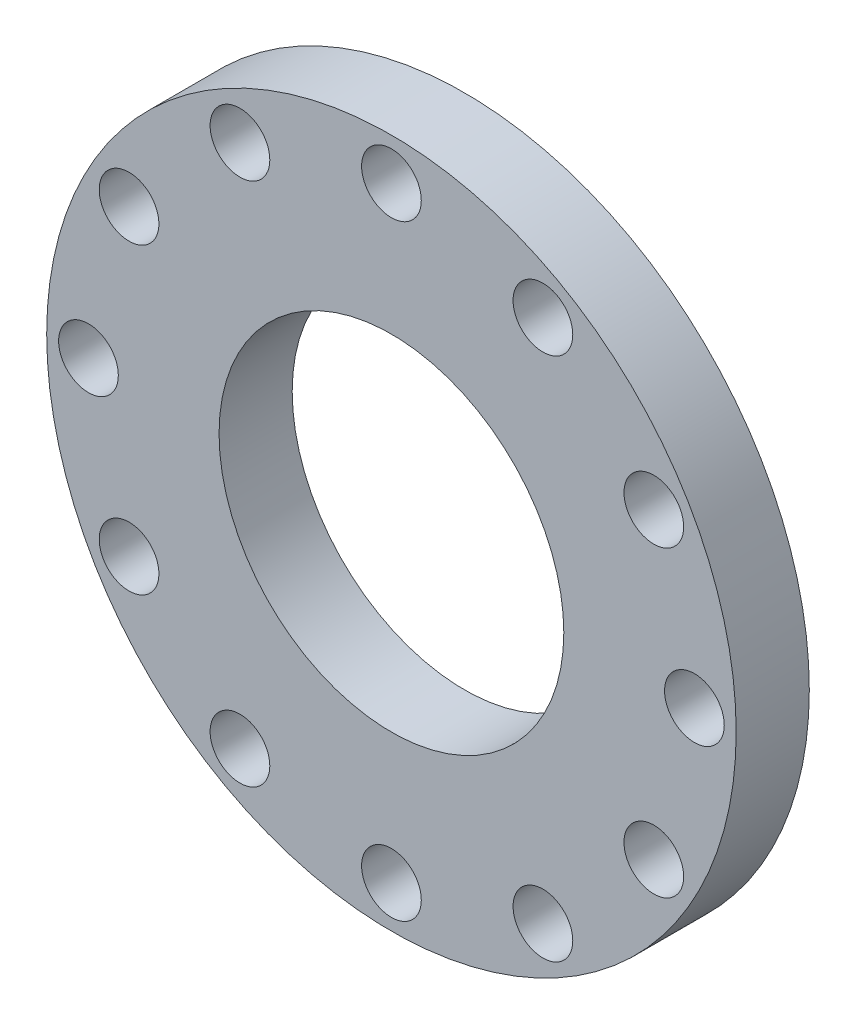
ISO-10303-21;
HEADER;
FILE_DESCRIPTION(('STEP AP214'),'2;1');
FILE_NAME('part.step','',(''),(''),'','','');
FILE_SCHEMA(('AUTOMOTIVE_DESIGN { 1 0 10303 214 1 1 1 1 }'));
ENDSEC;
DATA;
#1=APPLICATION_CONTEXT('core data for automotive mechanical design processes');
#2=APPLICATION_PROTOCOL_DEFINITION('international standard','automotive_design',2000,#1);
#3=PRODUCT_CONTEXT('',#1,'mechanical');
#4=PRODUCT('Part','Part','',(#3));
#5=PRODUCT_RELATED_PRODUCT_CATEGORY('part','',(#4));
#6=PRODUCT_DEFINITION_FORMATION('','',#4);
#7=PRODUCT_DEFINITION_CONTEXT('part definition',#1,'design');
#8=PRODUCT_DEFINITION('design','',#6,#7);
#9=PRODUCT_DEFINITION_SHAPE('','',#8);
#10=(LENGTH_UNIT() NAMED_UNIT(*) SI_UNIT(.MILLI.,.METRE.));
#11=(NAMED_UNIT(*) PLANE_ANGLE_UNIT() SI_UNIT($,.RADIAN.));
#12=(NAMED_UNIT(*) SI_UNIT($,.STERADIAN.) SOLID_ANGLE_UNIT());
#13=UNCERTAINTY_MEASURE_WITH_UNIT(LENGTH_MEASURE(1.E-05),#10,'distance_accuracy_value','');
#14=(GEOMETRIC_REPRESENTATION_CONTEXT(3) GLOBAL_UNCERTAINTY_ASSIGNED_CONTEXT((#13)) GLOBAL_UNIT_ASSIGNED_CONTEXT((#10,
#11,#12)) REPRESENTATION_CONTEXT('',''));
#15=CARTESIAN_POINT('',(0.,0.,0.));
#16=DIRECTION('',(0.,0.,1.));
#17=DIRECTION('',(1.,0.,0.));
#18=AXIS2_PLACEMENT_3D('',#15,#16,#17);
#19=CARTESIAN_POINT('',(0.,0.,70.));
#20=DIRECTION('',(0.,0.,1.));
#21=DIRECTION('',(1.,0.,0.));
#22=AXIS2_PLACEMENT_3D('',#19,#20,#21);
#23=PLANE('',#22);
#24=CARTESIAN_POINT('',(251.147367097493,145.000000000011,70.));
#25=DIRECTION('',(0.,0.,1.));
#26=DIRECTION('',(1.,0.,0.));
#27=AXIS2_PLACEMENT_3D('',#24,#25,#26);
#28=CIRCLE('',#27,28.5750000000034);
#29=CARTESIAN_POINT('',(279.722367097497,145.000000000011,70.));
#30=VERTEX_POINT('',#29);
#31=EDGE_CURVE('E64',#30,#30,#28,.F.);
#32=ORIENTED_EDGE('',*,*,#31,.T.);
#33=EDGE_LOOP('',(#32));
#34=FACE_BOUND('',#33,.T.);
#35=CARTESIAN_POINT('',(145.,251.147367097487,70.));
#36=DIRECTION('',(0.,0.,1.));
#37=DIRECTION('',(1.,0.,0.));
#38=AXIS2_PLACEMENT_3D('',#35,#36,#37);
#39=CIRCLE('',#38,28.575);
#40=CARTESIAN_POINT('',(173.575,251.147367097487,70.));
#41=VERTEX_POINT('',#40);
#42=EDGE_CURVE('E67',#41,#41,#39,.F.);
#43=ORIENTED_EDGE('',*,*,#42,.T.);
#44=EDGE_LOOP('',(#43));
#45=FACE_BOUND('',#44,.T.);
#46=CARTESIAN_POINT('',(0.,290.,70.));
#47=DIRECTION('',(0.,0.,1.));
#48=DIRECTION('',(1.,0.,0.));
#49=AXIS2_PLACEMENT_3D('',#46,#47,#48);
#50=CIRCLE('',#49,28.575);
#51=CARTESIAN_POINT('',(28.575,290.,70.));
#52=VERTEX_POINT('',#51);
#53=EDGE_CURVE('E70',#52,#52,#50,.F.);
#54=ORIENTED_EDGE('',*,*,#53,.T.);
#55=EDGE_LOOP('',(#54));
#56=FACE_BOUND('',#55,.T.);
#57=CARTESIAN_POINT('',(-144.999999999998,251.147367097481,70.));
#58=DIRECTION('',(0.,0.,1.));
#59=DIRECTION('',(1.,0.,0.));
#60=AXIS2_PLACEMENT_3D('',#57,#58,#59);
#61=CIRCLE('',#60,28.5750000000072);
#62=CARTESIAN_POINT('',(-116.424999999991,251.147367097481,70.));
#63=VERTEX_POINT('',#62);
#64=EDGE_CURVE('E73',#63,#63,#61,.F.);
#65=ORIENTED_EDGE('',*,*,#64,.T.);
#66=EDGE_LOOP('',(#65));
#67=FACE_BOUND('',#66,.T.);
#68=CARTESIAN_POINT('',(-251.147367097481,144.999999999989,70.));
#69=DIRECTION('',(0.,0.,1.));
#70=DIRECTION('',(1.,0.,0.));
#71=AXIS2_PLACEMENT_3D('',#68,#69,#70);
#72=CIRCLE('',#71,28.5750000000125);
#73=CARTESIAN_POINT('',(-222.572367097469,144.999999999989,70.));
#74=VERTEX_POINT('',#73);
#75=EDGE_CURVE('E76',#74,#74,#72,.F.);
#76=ORIENTED_EDGE('',*,*,#75,.T.);
#77=EDGE_LOOP('',(#76));
#78=FACE_BOUND('',#77,.T.);
#79=CARTESIAN_POINT('',(145.000000000023,-251.147367097481,70.));
#80=DIRECTION('',(0.,0.,1.));
#81=DIRECTION('',(1.,0.,0.));
#82=AXIS2_PLACEMENT_3D('',#79,#80,#81);
#83=CIRCLE('',#82,28.5750000000219);
#84=CARTESIAN_POINT('',(173.575000000045,-251.147367097481,70.));
#85=VERTEX_POINT('',#84);
#86=EDGE_CURVE('E79',#85,#85,#83,.F.);
#87=ORIENTED_EDGE('',*,*,#86,.T.);
#88=EDGE_LOOP('',(#87));
#89=FACE_BOUND('',#88,.T.);
#90=CARTESIAN_POINT('',(-144.999999999977,-251.147367097493,70.));
#91=DIRECTION('',(0.,0.,1.));
#92=DIRECTION('',(1.,0.,0.));
#93=AXIS2_PLACEMENT_3D('',#90,#91,#92);
#94=CIRCLE('',#93,28.5750000000261);
#95=CARTESIAN_POINT('',(-116.424999999951,-251.147367097493,70.));
#96=VERTEX_POINT('',#95);
#97=EDGE_CURVE('E82',#96,#96,#94,.F.);
#98=ORIENTED_EDGE('',*,*,#97,.T.);
#99=EDGE_LOOP('',(#98));
#100=FACE_BOUND('',#99,.T.);
#101=CARTESIAN_POINT('',(251.147367097506,-144.999999999989,70.));
#102=DIRECTION('',(0.,0.,1.));
#103=DIRECTION('',(1.,0.,0.));
#104=AXIS2_PLACEMENT_3D('',#101,#102,#103);
#105=CIRCLE('',#104,28.5750000000159);
#106=CARTESIAN_POINT('',(279.722367097522,-144.999999999989,70.));
#107=VERTEX_POINT('',#106);
#108=EDGE_CURVE('E85',#107,#107,#105,.F.);
#109=ORIENTED_EDGE('',*,*,#108,.T.);
#110=EDGE_LOOP('',(#109));
#111=FACE_BOUND('',#110,.T.);
#112=CARTESIAN_POINT('',(2.46558576901009E-11,-290.,70.));
#113=DIRECTION('',(0.,0.,1.));
#114=DIRECTION('',(1.,0.,0.));
#115=AXIS2_PLACEMENT_3D('',#112,#113,#114);
#116=CIRCLE('',#115,28.5750000000255);
#117=CARTESIAN_POINT('',(28.5750000000502,-290.,70.));
#118=VERTEX_POINT('',#117);
#119=EDGE_CURVE('E88',#118,#118,#116,.F.);
#120=ORIENTED_EDGE('',*,*,#119,.T.);
#121=EDGE_LOOP('',(#120));
#122=FACE_BOUND('',#121,.T.);
#123=CARTESIAN_POINT('',(-251.147367097469,-145.000000000011,70.));
#124=DIRECTION('',(0.,0.,1.));
#125=DIRECTION('',(1.,0.,0.));
#126=AXIS2_PLACEMENT_3D('',#123,#124,#125);
#127=CIRCLE('',#126,28.5750000000236);
#128=CARTESIAN_POINT('',(-222.572367097445,-145.000000000011,70.));
#129=VERTEX_POINT('',#128);
#130=EDGE_CURVE('E91',#129,#129,#127,.F.);
#131=ORIENTED_EDGE('',*,*,#130,.T.);
#132=EDGE_LOOP('',(#131));
#133=FACE_BOUND('',#132,.T.);
#134=CARTESIAN_POINT('',(-289.999999999988,-1.23634436022257E-11,70.));
#135=DIRECTION('',(0.,0.,1.));
#136=DIRECTION('',(1.,0.,0.));
#137=AXIS2_PLACEMENT_3D('',#134,#135,#136);
#138=CIRCLE('',#137,28.5750000000184);
#139=CARTESIAN_POINT('',(-261.424999999969,-1.23634436022257E-11,70.));
#140=VERTEX_POINT('',#139);
#141=EDGE_CURVE('E94',#140,#140,#138,.F.);
#142=ORIENTED_EDGE('',*,*,#141,.T.);
#143=EDGE_LOOP('',(#142));
#144=FACE_BOUND('',#143,.T.);
#145=CARTESIAN_POINT('',(290.000000000012,1.23279288450505E-11,70.));
#146=DIRECTION('',(0.,0.,1.));
#147=DIRECTION('',(1.,0.,0.));
#148=AXIS2_PLACEMENT_3D('',#145,#146,#147);
#149=CIRCLE('',#148,28.5750000000092);
#150=CARTESIAN_POINT('',(318.575000000021,1.23279288450505E-11,70.));
#151=VERTEX_POINT('',#150);
#152=EDGE_CURVE('E56',#151,#151,#149,.F.);
#153=ORIENTED_EDGE('',*,*,#152,.T.);
#154=EDGE_LOOP('',(#153));
#155=FACE_BOUND('',#154,.T.);
#156=CARTESIAN_POINT('',(0.,0.,70.));
#157=DIRECTION('',(0.,0.,1.));
#158=DIRECTION('',(1.,0.,0.));
#159=AXIS2_PLACEMENT_3D('',#156,#157,#158);
#160=CIRCLE('',#159,330.);
#161=CARTESIAN_POINT('',(330.,0.,70.));
#162=VERTEX_POINT('',#161);
#163=EDGE_CURVE('E11',#162,#162,#160,.T.);
#164=ORIENTED_EDGE('',*,*,#163,.T.);
#165=EDGE_LOOP('',(#164));
#166=FACE_BOUND('',#165,.T.);
#167=CARTESIAN_POINT('',(0.,0.,70.));
#168=DIRECTION('',(0.,0.,1.));
#169=DIRECTION('',(1.,0.,0.));
#170=AXIS2_PLACEMENT_3D('',#167,#168,#169);
#171=CIRCLE('',#170,165.);
#172=CARTESIAN_POINT('',(165.,0.,70.));
#173=VERTEX_POINT('',#172);
#174=EDGE_CURVE('E51',#173,#173,#171,.T.);
#175=ORIENTED_EDGE('',*,*,#174,.F.);
#176=EDGE_LOOP('',(#175));
#177=FACE_BOUND('',#176,.T.);
#178=ADVANCED_FACE('F40',(#34,#45,#56,#67,#78,#89,#100,#111,#122,#133,#144,#155,#166,#177),#23,.T.);
#179=CARTESIAN_POINT('',(0.,0.,0.));
#180=DIRECTION('',(0.,0.,1.));
#181=DIRECTION('',(1.,0.,0.));
#182=AXIS2_PLACEMENT_3D('',#179,#180,#181);
#183=PLANE('',#182);
#184=CARTESIAN_POINT('',(251.147367097493,145.000000000011,0.));
#185=DIRECTION('',(0.,0.,1.));
#186=DIRECTION('',(1.,0.,0.));
#187=AXIS2_PLACEMENT_3D('',#184,#185,#186);
#188=CIRCLE('',#187,28.5750000000034);
#189=CARTESIAN_POINT('',(279.722367097497,145.000000000011,0.));
#190=VERTEX_POINT('',#189);
#191=EDGE_CURVE('E97',#190,#190,#188,.T.);
#192=ORIENTED_EDGE('',*,*,#191,.T.);
#193=EDGE_LOOP('',(#192));
#194=FACE_BOUND('',#193,.T.);
#195=CARTESIAN_POINT('',(145.,251.147367097487,0.));
#196=DIRECTION('',(0.,0.,1.));
#197=DIRECTION('',(1.,0.,0.));
#198=AXIS2_PLACEMENT_3D('',#195,#196,#197);
#199=CIRCLE('',#198,28.575);
#200=CARTESIAN_POINT('',(173.575,251.147367097487,0.));
#201=VERTEX_POINT('',#200);
#202=EDGE_CURVE('E125',#201,#201,#199,.T.);
#203=ORIENTED_EDGE('',*,*,#202,.T.);
#204=EDGE_LOOP('',(#203));
#205=FACE_BOUND('',#204,.T.);
#206=CARTESIAN_POINT('',(0.,290.,0.));
#207=DIRECTION('',(0.,0.,1.));
#208=DIRECTION('',(1.,0.,0.));
#209=AXIS2_PLACEMENT_3D('',#206,#207,#208);
#210=CIRCLE('',#209,28.575);
#211=CARTESIAN_POINT('',(28.575,290.,0.));
#212=VERTEX_POINT('',#211);
#213=EDGE_CURVE('E122',#212,#212,#210,.T.);
#214=ORIENTED_EDGE('',*,*,#213,.T.);
#215=EDGE_LOOP('',(#214));
#216=FACE_BOUND('',#215,.T.);
#217=CARTESIAN_POINT('',(-144.999999999998,251.147367097481,0.));
#218=DIRECTION('',(0.,0.,1.));
#219=DIRECTION('',(1.,0.,0.));
#220=AXIS2_PLACEMENT_3D('',#217,#218,#219);
#221=CIRCLE('',#220,28.5750000000072);
#222=CARTESIAN_POINT('',(-116.424999999991,251.147367097481,0.));
#223=VERTEX_POINT('',#222);
#224=EDGE_CURVE('E119',#223,#223,#221,.T.);
#225=ORIENTED_EDGE('',*,*,#224,.T.);
#226=EDGE_LOOP('',(#225));
#227=FACE_BOUND('',#226,.T.);
#228=CARTESIAN_POINT('',(-251.147367097481,144.999999999989,0.));
#229=DIRECTION('',(0.,0.,1.));
#230=DIRECTION('',(1.,0.,0.));
#231=AXIS2_PLACEMENT_3D('',#228,#229,#230);
#232=CIRCLE('',#231,28.5750000000125);
#233=CARTESIAN_POINT('',(-222.572367097469,144.999999999989,0.));
#234=VERTEX_POINT('',#233);
#235=EDGE_CURVE('E108',#234,#234,#232,.T.);
#236=ORIENTED_EDGE('',*,*,#235,.T.);
#237=EDGE_LOOP('',(#236));
#238=FACE_BOUND('',#237,.T.);
#239=CARTESIAN_POINT('',(145.000000000023,-251.147367097481,0.));
#240=DIRECTION('',(0.,0.,1.));
#241=DIRECTION('',(1.,0.,0.));
#242=AXIS2_PLACEMENT_3D('',#239,#240,#241);
#243=CIRCLE('',#242,28.5750000000219);
#244=CARTESIAN_POINT('',(173.575000000045,-251.147367097481,0.));
#245=VERTEX_POINT('',#244);
#246=EDGE_CURVE('E109',#245,#245,#243,.T.);
#247=ORIENTED_EDGE('',*,*,#246,.T.);
#248=EDGE_LOOP('',(#247));
#249=FACE_BOUND('',#248,.T.);
#250=CARTESIAN_POINT('',(-144.999999999977,-251.147367097493,0.));
#251=DIRECTION('',(0.,0.,1.));
#252=DIRECTION('',(1.,0.,0.));
#253=AXIS2_PLACEMENT_3D('',#250,#251,#252);
#254=CIRCLE('',#253,28.5750000000261);
#255=CARTESIAN_POINT('',(-116.424999999951,-251.147367097493,0.));
#256=VERTEX_POINT('',#255);
#257=EDGE_CURVE('E112',#256,#256,#254,.T.);
#258=ORIENTED_EDGE('',*,*,#257,.T.);
#259=EDGE_LOOP('',(#258));
#260=FACE_BOUND('',#259,.T.);
#261=CARTESIAN_POINT('',(251.147367097506,-144.999999999989,0.));
#262=DIRECTION('',(0.,0.,1.));
#263=DIRECTION('',(1.,0.,0.));
#264=AXIS2_PLACEMENT_3D('',#261,#262,#263);
#265=CIRCLE('',#264,28.5750000000159);
#266=CARTESIAN_POINT('',(279.722367097522,-144.999999999989,0.));
#267=VERTEX_POINT('',#266);
#268=EDGE_CURVE('E102',#267,#267,#265,.T.);
#269=ORIENTED_EDGE('',*,*,#268,.T.);
#270=EDGE_LOOP('',(#269));
#271=FACE_BOUND('',#270,.T.);
#272=CARTESIAN_POINT('',(2.46558576901009E-11,-290.,0.));
#273=DIRECTION('',(0.,0.,1.));
#274=DIRECTION('',(1.,0.,0.));
#275=AXIS2_PLACEMENT_3D('',#272,#273,#274);
#276=CIRCLE('',#275,28.5750000000255);
#277=CARTESIAN_POINT('',(28.5750000000502,-290.,0.));
#278=VERTEX_POINT('',#277);
#279=EDGE_CURVE('E98',#278,#278,#276,.T.);
#280=ORIENTED_EDGE('',*,*,#279,.T.);
#281=EDGE_LOOP('',(#280));
#282=FACE_BOUND('',#281,.T.);
#283=CARTESIAN_POINT('',(-251.147367097469,-145.000000000011,0.));
#284=DIRECTION('',(0.,0.,1.));
#285=DIRECTION('',(1.,0.,0.));
#286=AXIS2_PLACEMENT_3D('',#283,#284,#285);
#287=CIRCLE('',#286,28.5750000000236);
#288=CARTESIAN_POINT('',(-222.572367097445,-145.000000000011,0.));
#289=VERTEX_POINT('',#288);
#290=EDGE_CURVE('E101',#289,#289,#287,.T.);
#291=ORIENTED_EDGE('',*,*,#290,.T.);
#292=EDGE_LOOP('',(#291));
#293=FACE_BOUND('',#292,.T.);
#294=CARTESIAN_POINT('',(-289.999999999988,-1.23634436022257E-11,0.));
#295=DIRECTION('',(0.,0.,1.));
#296=DIRECTION('',(1.,0.,0.));
#297=AXIS2_PLACEMENT_3D('',#294,#295,#296);
#298=CIRCLE('',#297,28.5750000000184);
#299=CARTESIAN_POINT('',(-261.424999999969,-1.23634436022257E-11,0.));
#300=VERTEX_POINT('',#299);
#301=EDGE_CURVE('E105',#300,#300,#298,.T.);
#302=ORIENTED_EDGE('',*,*,#301,.T.);
#303=EDGE_LOOP('',(#302));
#304=FACE_BOUND('',#303,.T.);
#305=CARTESIAN_POINT('',(290.000000000012,1.23279288450505E-11,0.));
#306=DIRECTION('',(0.,0.,1.));
#307=DIRECTION('',(1.,0.,0.));
#308=AXIS2_PLACEMENT_3D('',#305,#306,#307);
#309=CIRCLE('',#308,28.5750000000092);
#310=CARTESIAN_POINT('',(318.575000000021,1.23279288450505E-11,0.));
#311=VERTEX_POINT('',#310);
#312=EDGE_CURVE('E61',#311,#311,#309,.T.);
#313=ORIENTED_EDGE('',*,*,#312,.T.);
#314=EDGE_LOOP('',(#313));
#315=FACE_BOUND('',#314,.T.);
#316=CARTESIAN_POINT('',(0.,0.,0.));
#317=DIRECTION('',(0.,0.,1.));
#318=DIRECTION('',(1.,0.,0.));
#319=AXIS2_PLACEMENT_3D('',#316,#317,#318);
#320=CIRCLE('',#319,330.);
#321=CARTESIAN_POINT('',(330.,0.,0.));
#322=VERTEX_POINT('',#321);
#323=EDGE_CURVE('E44',#322,#322,#320,.T.);
#324=ORIENTED_EDGE('',*,*,#323,.F.);
#325=EDGE_LOOP('',(#324));
#326=FACE_BOUND('',#325,.T.);
#327=CARTESIAN_POINT('',(0.,0.,0.));
#328=DIRECTION('',(0.,0.,1.));
#329=DIRECTION('',(1.,0.,0.));
#330=AXIS2_PLACEMENT_3D('',#327,#328,#329);
#331=CIRCLE('',#330,165.);
#332=CARTESIAN_POINT('',(165.,0.,0.));
#333=VERTEX_POINT('',#332);
#334=EDGE_CURVE('E53',#333,#333,#331,.T.);
#335=ORIENTED_EDGE('',*,*,#334,.T.);
#336=EDGE_LOOP('',(#335));
#337=FACE_BOUND('',#336,.T.);
#338=ADVANCED_FACE('F131',(#194,#205,#216,#227,#238,#249,#260,#271,#282,#293,#304,#315,#326,
#337),#183,.F.);
#339=CARTESIAN_POINT('',(0.,0.,70.));
#340=DIRECTION('',(0.,0.,-1.));
#341=DIRECTION('',(-1.,0.,0.));
#342=AXIS2_PLACEMENT_3D('',#339,#340,#341);
#343=CYLINDRICAL_SURFACE('',#342,330.);
#344=ORIENTED_EDGE('',*,*,#163,.F.);
#345=EDGE_LOOP('',(#344));
#346=FACE_BOUND('',#345,.T.);
#347=ORIENTED_EDGE('',*,*,#323,.T.);
#348=EDGE_LOOP('',(#347));
#349=FACE_BOUND('',#348,.T.);
#350=ADVANCED_FACE('F42',(#346,#349),#343,.T.);
#351=CARTESIAN_POINT('',(0.,0.,70.));
#352=DIRECTION('',(0.,0.,-1.));
#353=DIRECTION('',(-1.,0.,0.));
#354=AXIS2_PLACEMENT_3D('',#351,#352,#353);
#355=CYLINDRICAL_SURFACE('',#354,165.);
#356=ORIENTED_EDGE('',*,*,#174,.T.);
#357=EDGE_LOOP('',(#356));
#358=FACE_BOUND('',#357,.T.);
#359=ORIENTED_EDGE('',*,*,#334,.F.);
#360=EDGE_LOOP('',(#359));
#361=FACE_BOUND('',#360,.T.);
#362=ADVANCED_FACE('F154',(#358,#361),#355,.F.);
#363=CARTESIAN_POINT('',(290.000000000012,1.23279288450505E-11,131.));
#364=DIRECTION('',(0.,0.,-1.));
#365=DIRECTION('',(-1.,0.,0.));
#366=AXIS2_PLACEMENT_3D('',#363,#364,#365);
#367=CYLINDRICAL_SURFACE('',#366,28.5750000000092);
#368=ORIENTED_EDGE('',*,*,#152,.F.);
#369=EDGE_LOOP('',(#368));
#370=FACE_BOUND('',#369,.T.);
#371=ORIENTED_EDGE('',*,*,#312,.F.);
#372=EDGE_LOOP('',(#371));
#373=FACE_BOUND('',#372,.T.);
#374=ADVANCED_FACE('F157',(#370,#373),#367,.F.);
#375=CARTESIAN_POINT('',(-289.999999999988,-1.23634436022257E-11,131.));
#376=DIRECTION('',(0.,0.,-1.));
#377=DIRECTION('',(-1.,0.,0.));
#378=AXIS2_PLACEMENT_3D('',#375,#376,#377);
#379=CYLINDRICAL_SURFACE('',#378,28.5750000000184);
#380=ORIENTED_EDGE('',*,*,#141,.F.);
#381=EDGE_LOOP('',(#380));
#382=FACE_BOUND('',#381,.T.);
#383=ORIENTED_EDGE('',*,*,#301,.F.);
#384=EDGE_LOOP('',(#383));
#385=FACE_BOUND('',#384,.T.);
#386=ADVANCED_FACE('F161',(#382,#385),#379,.F.);
#387=CARTESIAN_POINT('',(-251.147367097469,-145.000000000011,131.));
#388=DIRECTION('',(0.,0.,-1.));
#389=DIRECTION('',(-1.,0.,0.));
#390=AXIS2_PLACEMENT_3D('',#387,#388,#389);
#391=CYLINDRICAL_SURFACE('',#390,28.5750000000236);
#392=ORIENTED_EDGE('',*,*,#130,.F.);
#393=EDGE_LOOP('',(#392));
#394=FACE_BOUND('',#393,.T.);
#395=ORIENTED_EDGE('',*,*,#290,.F.);
#396=EDGE_LOOP('',(#395));
#397=FACE_BOUND('',#396,.T.);
#398=ADVANCED_FACE('F167',(#394,#397),#391,.F.);
#399=CARTESIAN_POINT('',(2.46558576901009E-11,-290.,131.));
#400=DIRECTION('',(0.,0.,-1.));
#401=DIRECTION('',(-1.,0.,0.));
#402=AXIS2_PLACEMENT_3D('',#399,#400,#401);
#403=CYLINDRICAL_SURFACE('',#402,28.5750000000255);
#404=ORIENTED_EDGE('',*,*,#119,.F.);
#405=EDGE_LOOP('',(#404));
#406=FACE_BOUND('',#405,.T.);
#407=ORIENTED_EDGE('',*,*,#279,.F.);
#408=EDGE_LOOP('',(#407));
#409=FACE_BOUND('',#408,.T.);
#410=ADVANCED_FACE('F163',(#406,#409),#403,.F.);
#411=CARTESIAN_POINT('',(251.147367097506,-144.999999999989,131.));
#412=DIRECTION('',(0.,0.,-1.));
#413=DIRECTION('',(-1.,0.,0.));
#414=AXIS2_PLACEMENT_3D('',#411,#412,#413);
#415=CYLINDRICAL_SURFACE('',#414,28.5750000000159);
#416=ORIENTED_EDGE('',*,*,#108,.F.);
#417=EDGE_LOOP('',(#416));
#418=FACE_BOUND('',#417,.T.);
#419=ORIENTED_EDGE('',*,*,#268,.F.);
#420=EDGE_LOOP('',(#419));
#421=FACE_BOUND('',#420,.T.);
#422=ADVANCED_FACE('F166',(#418,#421),#415,.F.);
#423=CARTESIAN_POINT('',(-144.999999999977,-251.147367097493,131.));
#424=DIRECTION('',(0.,0.,-1.));
#425=DIRECTION('',(-1.,0.,0.));
#426=AXIS2_PLACEMENT_3D('',#423,#424,#425);
#427=CYLINDRICAL_SURFACE('',#426,28.5750000000261);
#428=ORIENTED_EDGE('',*,*,#97,.F.);
#429=EDGE_LOOP('',(#428));
#430=FACE_BOUND('',#429,.T.);
#431=ORIENTED_EDGE('',*,*,#257,.F.);
#432=EDGE_LOOP('',(#431));
#433=FACE_BOUND('',#432,.T.);
#434=ADVANCED_FACE('F179',(#430,#433),#427,.F.);
#435=CARTESIAN_POINT('',(145.000000000023,-251.147367097481,131.));
#436=DIRECTION('',(0.,0.,-1.));
#437=DIRECTION('',(-1.,0.,0.));
#438=AXIS2_PLACEMENT_3D('',#435,#436,#437);
#439=CYLINDRICAL_SURFACE('',#438,28.5750000000219);
#440=ORIENTED_EDGE('',*,*,#86,.F.);
#441=EDGE_LOOP('',(#440));
#442=FACE_BOUND('',#441,.T.);
#443=ORIENTED_EDGE('',*,*,#246,.F.);
#444=EDGE_LOOP('',(#443));
#445=FACE_BOUND('',#444,.T.);
#446=ADVANCED_FACE('F175',(#442,#445),#439,.F.);
#447=CARTESIAN_POINT('',(-251.147367097481,144.999999999989,131.));
#448=DIRECTION('',(0.,0.,-1.));
#449=DIRECTION('',(-1.,0.,0.));
#450=AXIS2_PLACEMENT_3D('',#447,#448,#449);
#451=CYLINDRICAL_SURFACE('',#450,28.5750000000125);
#452=ORIENTED_EDGE('',*,*,#75,.F.);
#453=EDGE_LOOP('',(#452));
#454=FACE_BOUND('',#453,.T.);
#455=ORIENTED_EDGE('',*,*,#235,.F.);
#456=EDGE_LOOP('',(#455));
#457=FACE_BOUND('',#456,.T.);
#458=ADVANCED_FACE('F178',(#454,#457),#451,.F.);
#459=CARTESIAN_POINT('',(-144.999999999998,251.147367097481,131.));
#460=DIRECTION('',(0.,0.,-1.));
#461=DIRECTION('',(-1.,0.,0.));
#462=AXIS2_PLACEMENT_3D('',#459,#460,#461);
#463=CYLINDRICAL_SURFACE('',#462,28.5750000000072);
#464=ORIENTED_EDGE('',*,*,#64,.F.);
#465=EDGE_LOOP('',(#464));
#466=FACE_BOUND('',#465,.T.);
#467=ORIENTED_EDGE('',*,*,#224,.F.);
#468=EDGE_LOOP('',(#467));
#469=FACE_BOUND('',#468,.T.);
#470=ADVANCED_FACE('F189',(#466,#469),#463,.F.);
#471=CARTESIAN_POINT('',(0.,290.,131.));
#472=DIRECTION('',(0.,0.,-1.));
#473=DIRECTION('',(-1.,0.,0.));
#474=AXIS2_PLACEMENT_3D('',#471,#472,#473);
#475=CYLINDRICAL_SURFACE('',#474,28.575);
#476=ORIENTED_EDGE('',*,*,#53,.F.);
#477=EDGE_LOOP('',(#476));
#478=FACE_BOUND('',#477,.T.);
#479=ORIENTED_EDGE('',*,*,#213,.F.);
#480=EDGE_LOOP('',(#479));
#481=FACE_BOUND('',#480,.T.);
#482=ADVANCED_FACE('F142',(#478,#481),#475,.F.);
#483=CARTESIAN_POINT('',(145.,251.147367097487,131.));
#484=DIRECTION('',(0.,0.,-1.));
#485=DIRECTION('',(-1.,0.,0.));
#486=AXIS2_PLACEMENT_3D('',#483,#484,#485);
#487=CYLINDRICAL_SURFACE('',#486,28.575);
#488=ORIENTED_EDGE('',*,*,#42,.F.);
#489=EDGE_LOOP('',(#488));
#490=FACE_BOUND('',#489,.T.);
#491=ORIENTED_EDGE('',*,*,#202,.F.);
#492=EDGE_LOOP('',(#491));
#493=FACE_BOUND('',#492,.T.);
#494=ADVANCED_FACE('F136',(#490,#493),#487,.F.);
#495=CARTESIAN_POINT('',(251.147367097493,145.000000000011,131.));
#496=DIRECTION('',(0.,0.,-1.));
#497=DIRECTION('',(-1.,0.,0.));
#498=AXIS2_PLACEMENT_3D('',#495,#496,#497);
#499=CYLINDRICAL_SURFACE('',#498,28.5750000000034);
#500=ORIENTED_EDGE('',*,*,#31,.F.);
#501=EDGE_LOOP('',(#500));
#502=FACE_BOUND('',#501,.T.);
#503=ORIENTED_EDGE('',*,*,#191,.F.);
#504=EDGE_LOOP('',(#503));
#505=FACE_BOUND('',#504,.T.);
#506=ADVANCED_FACE('F134',(#502,#505),#499,.F.);
#507=CLOSED_SHELL('',(#178,#338,#350,#362,#374,#386,#398,#410,#422,#434,#446,#458,#470,#482,
#494,#506));
#508=MANIFOLD_SOLID_BREP('B2',#507);
#509=ADVANCED_BREP_SHAPE_REPRESENTATION('',(#18,#508),#14);
#510=SHAPE_DEFINITION_REPRESENTATION(#9,#509);
ENDSEC;
END-ISO-10303-21;
